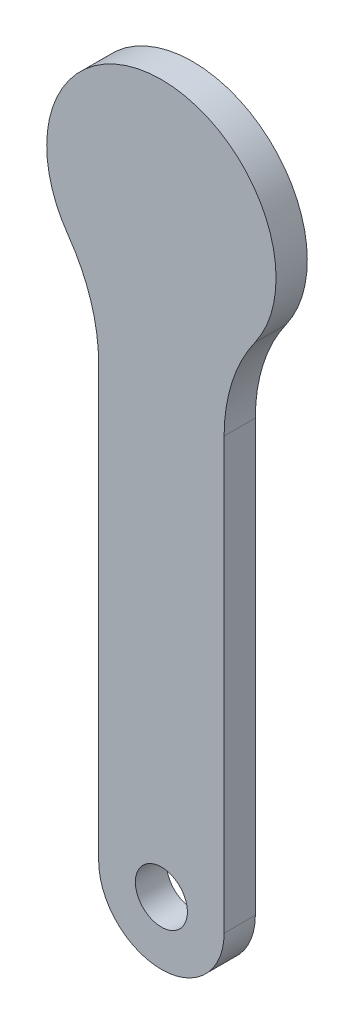
ISO-10303-21;
HEADER;
FILE_DESCRIPTION(('STEP AP214'),'2;1');
FILE_NAME('part.step','',(''),(''),'','','');
FILE_SCHEMA(('AUTOMOTIVE_DESIGN { 1 0 10303 214 1 1 1 1 }'));
ENDSEC;
DATA;
#1=APPLICATION_CONTEXT('core data for automotive mechanical design processes');
#2=APPLICATION_PROTOCOL_DEFINITION('international standard','automotive_design',2000,#1);
#3=PRODUCT_CONTEXT('',#1,'mechanical');
#4=PRODUCT('Part','Part','',(#3));
#5=PRODUCT_RELATED_PRODUCT_CATEGORY('part','',(#4));
#6=PRODUCT_DEFINITION_FORMATION('','',#4);
#7=PRODUCT_DEFINITION_CONTEXT('part definition',#1,'design');
#8=PRODUCT_DEFINITION('design','',#6,#7);
#9=PRODUCT_DEFINITION_SHAPE('','',#8);
#10=(LENGTH_UNIT() NAMED_UNIT(*) SI_UNIT(.MILLI.,.METRE.));
#11=(NAMED_UNIT(*) PLANE_ANGLE_UNIT() SI_UNIT($,.RADIAN.));
#12=(NAMED_UNIT(*) SI_UNIT($,.STERADIAN.) SOLID_ANGLE_UNIT());
#13=UNCERTAINTY_MEASURE_WITH_UNIT(LENGTH_MEASURE(1.E-05),#10,'distance_accuracy_value','');
#14=(GEOMETRIC_REPRESENTATION_CONTEXT(3) GLOBAL_UNCERTAINTY_ASSIGNED_CONTEXT((#13)) GLOBAL_UNIT_ASSIGNED_CONTEXT((#10,
#11,#12)) REPRESENTATION_CONTEXT('',''));
#15=CARTESIAN_POINT('',(0.,0.,0.));
#16=DIRECTION('',(0.,0.,1.));
#17=DIRECTION('',(1.,0.,0.));
#18=AXIS2_PLACEMENT_3D('',#15,#16,#17);
#19=CARTESIAN_POINT('',(22.0049394238987,-15.636232903161,3.));
#20=DIRECTION('',(0.,0.,-1.));
#21=DIRECTION('',(-1.,0.,0.));
#22=AXIS2_PLACEMENT_3D('',#19,#20,#21);
#23=PLANE('',#22);
#24=CARTESIAN_POINT('',(22.0049394238987,-15.636232903161,3.));
#25=DIRECTION('',(0.,0.,-1.));
#26=DIRECTION('',(-1.,0.,0.));
#27=AXIS2_PLACEMENT_3D('',#24,#25,#26);
#28=CIRCLE('',#27,15.9798002931745);
#29=CARTESIAN_POINT('',(6.02513913072419,-15.636232903161,3.));
#30=VERTEX_POINT('',#29);
#31=CARTESIAN_POINT('',(8.97883915477203,-6.38016844852385,3.));
#32=VERTEX_POINT('',#31);
#33=EDGE_CURVE('E131',#30,#32,#28,.T.);
#34=ORIENTED_EDGE('',*,*,#33,.T.);
#35=CARTESIAN_POINT('',(0.,0.,3.));
#36=DIRECTION('',(0.,0.,1.));
#37=DIRECTION('',(-1.,0.,0.));
#38=AXIS2_PLACEMENT_3D('',#35,#36,#37);
#39=CIRCLE('',#38,11.0148128444748);
#40=CARTESIAN_POINT('',(-8.97883915477204,-6.38016844852385,3.));
#41=VERTEX_POINT('',#40);
#42=EDGE_CURVE('E88',#32,#41,#39,.T.);
#43=ORIENTED_EDGE('',*,*,#42,.T.);
#44=CARTESIAN_POINT('',(-22.0049394238987,-15.636232903161,3.));
#45=DIRECTION('',(0.,0.,-1.));
#46=DIRECTION('',(1.,0.,0.));
#47=AXIS2_PLACEMENT_3D('',#44,#45,#46);
#48=CIRCLE('',#47,15.9798002931745);
#49=CARTESIAN_POINT('',(-6.02513913072419,-15.636232903161,3.));
#50=VERTEX_POINT('',#49);
#51=EDGE_CURVE('E101',#41,#50,#48,.T.);
#52=ORIENTED_EDGE('',*,*,#51,.T.);
#53=DIRECTION('',(0.,-1.,0.));
#54=VECTOR('',#53,1.);
#55=CARTESIAN_POINT('',(-6.02513913072419,-15.636232903161,3.));
#56=LINE('',#55,#54);
#57=CARTESIAN_POINT('',(-6.02513913072419,-57.,3.));
#58=VERTEX_POINT('',#57);
#59=EDGE_CURVE('E95',#50,#58,#56,.T.);
#60=ORIENTED_EDGE('',*,*,#59,.T.);
#61=CARTESIAN_POINT('',(0.,-57.,3.));
#62=DIRECTION('',(0.,0.,1.));
#63=DIRECTION('',(1.,0.,0.));
#64=AXIS2_PLACEMENT_3D('',#61,#62,#63);
#65=CIRCLE('',#64,6.0251391307242);
#66=CARTESIAN_POINT('',(6.0251391307242,-57.,3.));
#67=VERTEX_POINT('',#66);
#68=EDGE_CURVE('E99',#58,#67,#65,.T.);
#69=ORIENTED_EDGE('',*,*,#68,.T.);
#70=DIRECTION('',(0.,1.,0.));
#71=VECTOR('',#70,1.);
#72=CARTESIAN_POINT('',(6.02513913072419,-15.636232903161,3.));
#73=LINE('',#72,#71);
#74=EDGE_CURVE('E52',#67,#30,#73,.T.);
#75=ORIENTED_EDGE('',*,*,#74,.T.);
#76=EDGE_LOOP('',(#34,#43,#52,#60,#69,#75));
#77=FACE_BOUND('',#76,.T.);
#78=CARTESIAN_POINT('',(0.,-57.,3.));
#79=DIRECTION('',(0.,0.,1.));
#80=DIRECTION('',(1.,0.,0.));
#81=AXIS2_PLACEMENT_3D('',#78,#79,#80);
#82=CIRCLE('',#81,2.5);
#83=CARTESIAN_POINT('',(2.50000000000001,-57.,3.));
#84=VERTEX_POINT('',#83);
#85=EDGE_CURVE('E124',#84,#84,#82,.T.);
#86=ORIENTED_EDGE('',*,*,#85,.F.);
#87=EDGE_LOOP('',(#86));
#88=FACE_BOUND('',#87,.T.);
#89=ADVANCED_FACE('F35',(#77,#88),#23,.F.);
#90=CARTESIAN_POINT('',(22.0049394238987,-15.636232903161,0.));
#91=DIRECTION('',(0.,0.,-1.));
#92=DIRECTION('',(-1.,0.,0.));
#93=AXIS2_PLACEMENT_3D('',#90,#91,#92);
#94=PLANE('',#93);
#95=CARTESIAN_POINT('',(22.0049394238987,-15.636232903161,0.));
#96=DIRECTION('',(0.,0.,-1.));
#97=DIRECTION('',(-1.,0.,0.));
#98=AXIS2_PLACEMENT_3D('',#95,#96,#97);
#99=CIRCLE('',#98,15.9798002931745);
#100=CARTESIAN_POINT('',(6.02513913072419,-15.636232903161,0.));
#101=VERTEX_POINT('',#100);
#102=CARTESIAN_POINT('',(8.97883915477203,-6.38016844852385,0.));
#103=VERTEX_POINT('',#102);
#104=EDGE_CURVE('E120',#101,#103,#99,.T.);
#105=ORIENTED_EDGE('',*,*,#104,.F.);
#106=DIRECTION('',(0.,1.,0.));
#107=VECTOR('',#106,1.);
#108=CARTESIAN_POINT('',(6.02513913072419,-15.636232903161,0.));
#109=LINE('',#108,#107);
#110=CARTESIAN_POINT('',(6.0251391307242,-57.,0.));
#111=VERTEX_POINT('',#110);
#112=EDGE_CURVE('E80',#111,#101,#109,.T.);
#113=ORIENTED_EDGE('',*,*,#112,.F.);
#114=CARTESIAN_POINT('',(0.,-57.,0.));
#115=DIRECTION('',(0.,0.,1.));
#116=DIRECTION('',(-1.,0.,0.));
#117=AXIS2_PLACEMENT_3D('',#114,#115,#116);
#118=CIRCLE('',#117,6.0251391307242);
#119=CARTESIAN_POINT('',(-6.02513913072419,-57.,0.));
#120=VERTEX_POINT('',#119);
#121=EDGE_CURVE('E74',#120,#111,#118,.T.);
#122=ORIENTED_EDGE('',*,*,#121,.F.);
#123=DIRECTION('',(0.,-1.,0.));
#124=VECTOR('',#123,1.);
#125=CARTESIAN_POINT('',(-6.02513913072419,-15.636232903161,0.));
#126=LINE('',#125,#124);
#127=CARTESIAN_POINT('',(-6.02513913072419,-15.636232903161,0.));
#128=VERTEX_POINT('',#127);
#129=EDGE_CURVE('E110',#128,#120,#126,.T.);
#130=ORIENTED_EDGE('',*,*,#129,.F.);
#131=CARTESIAN_POINT('',(-22.0049394238987,-15.636232903161,0.));
#132=DIRECTION('',(0.,0.,-1.));
#133=DIRECTION('',(1.,0.,0.));
#134=AXIS2_PLACEMENT_3D('',#131,#132,#133);
#135=CIRCLE('',#134,15.9798002931745);
#136=CARTESIAN_POINT('',(-8.97883915477204,-6.38016844852385,0.));
#137=VERTEX_POINT('',#136);
#138=EDGE_CURVE('E126',#137,#128,#135,.T.);
#139=ORIENTED_EDGE('',*,*,#138,.F.);
#140=CARTESIAN_POINT('',(0.,0.,0.));
#141=DIRECTION('',(0.,0.,1.));
#142=DIRECTION('',(-1.,0.,0.));
#143=AXIS2_PLACEMENT_3D('',#140,#141,#142);
#144=CIRCLE('',#143,11.0148128444748);
#145=EDGE_CURVE('E123',#103,#137,#144,.T.);
#146=ORIENTED_EDGE('',*,*,#145,.F.);
#147=EDGE_LOOP('',(#105,#113,#122,#130,#139,#146));
#148=FACE_BOUND('',#147,.T.);
#149=CARTESIAN_POINT('',(0.,-57.,0.));
#150=DIRECTION('',(0.,0.,1.));
#151=DIRECTION('',(1.,0.,0.));
#152=AXIS2_PLACEMENT_3D('',#149,#150,#151);
#153=CIRCLE('',#152,2.5);
#154=CARTESIAN_POINT('',(2.50000000000001,-57.,0.));
#155=VERTEX_POINT('',#154);
#156=EDGE_CURVE('E227',#155,#155,#153,.T.);
#157=ORIENTED_EDGE('',*,*,#156,.T.);
#158=EDGE_LOOP('',(#157));
#159=FACE_BOUND('',#158,.T.);
#160=ADVANCED_FACE('F140',(#148,#159),#94,.T.);
#161=CARTESIAN_POINT('',(22.0049394238987,-15.636232903161,3.));
#162=DIRECTION('',(0.,0.,-1.));
#163=DIRECTION('',(-1.,0.,0.));
#164=AXIS2_PLACEMENT_3D('',#161,#162,#163);
#165=CYLINDRICAL_SURFACE('',#164,15.9798002931745);
#166=ORIENTED_EDGE('',*,*,#104,.T.);
#167=DIRECTION('',(0.,0.,-1.));
#168=VECTOR('',#167,1.);
#169=CARTESIAN_POINT('',(8.97883915477203,-6.38016844852385,3.));
#170=LINE('',#169,#168);
#171=EDGE_CURVE('E11',#32,#103,#170,.T.);
#172=ORIENTED_EDGE('',*,*,#171,.F.);
#173=ORIENTED_EDGE('',*,*,#33,.F.);
#174=DIRECTION('',(0.,0.,-1.));
#175=VECTOR('',#174,1.);
#176=CARTESIAN_POINT('',(6.02513913072419,-15.636232903161,3.));
#177=LINE('',#176,#175);
#178=EDGE_CURVE('E116',#30,#101,#177,.T.);
#179=ORIENTED_EDGE('',*,*,#178,.T.);
#180=EDGE_LOOP('',(#166,#172,#173,#179));
#181=FACE_BOUND('',#180,.T.);
#182=ADVANCED_FACE('F37',(#181),#165,.F.);
#183=CARTESIAN_POINT('',(0.,0.,3.));
#184=DIRECTION('',(0.,0.,-1.));
#185=DIRECTION('',(-1.,0.,0.));
#186=AXIS2_PLACEMENT_3D('',#183,#184,#185);
#187=CYLINDRICAL_SURFACE('',#186,11.0148128444748);
#188=ORIENTED_EDGE('',*,*,#145,.T.);
#189=DIRECTION('',(0.,0.,-1.));
#190=VECTOR('',#189,1.);
#191=CARTESIAN_POINT('',(-8.97883915477204,-6.38016844852385,3.));
#192=LINE('',#191,#190);
#193=EDGE_CURVE('E44',#41,#137,#192,.T.);
#194=ORIENTED_EDGE('',*,*,#193,.F.);
#195=ORIENTED_EDGE('',*,*,#42,.F.);
#196=ORIENTED_EDGE('',*,*,#171,.T.);
#197=EDGE_LOOP('',(#188,#194,#195,#196));
#198=FACE_BOUND('',#197,.T.);
#199=ADVANCED_FACE('F165',(#198),#187,.T.);
#200=CARTESIAN_POINT('',(-22.0049394238987,-15.636232903161,3.));
#201=DIRECTION('',(0.,0.,-1.));
#202=DIRECTION('',(-1.,0.,0.));
#203=AXIS2_PLACEMENT_3D('',#200,#201,#202);
#204=CYLINDRICAL_SURFACE('',#203,15.9798002931745);
#205=ORIENTED_EDGE('',*,*,#138,.T.);
#206=DIRECTION('',(0.,0.,-1.));
#207=VECTOR('',#206,1.);
#208=CARTESIAN_POINT('',(-6.02513913072419,-15.636232903161,3.));
#209=LINE('',#208,#207);
#210=EDGE_CURVE('E111',#50,#128,#209,.T.);
#211=ORIENTED_EDGE('',*,*,#210,.F.);
#212=ORIENTED_EDGE('',*,*,#51,.F.);
#213=ORIENTED_EDGE('',*,*,#193,.T.);
#214=EDGE_LOOP('',(#205,#211,#212,#213));
#215=FACE_BOUND('',#214,.T.);
#216=ADVANCED_FACE('F137',(#215),#204,.F.);
#217=CARTESIAN_POINT('',(-6.02513913072419,-15.636232903161,3.));
#218=DIRECTION('',(1.,0.,0.));
#219=DIRECTION('',(0.,1.,0.));
#220=AXIS2_PLACEMENT_3D('',#217,#218,#219);
#221=PLANE('',#220);
#222=ORIENTED_EDGE('',*,*,#129,.T.);
#223=DIRECTION('',(0.,0.,-1.));
#224=VECTOR('',#223,1.);
#225=CARTESIAN_POINT('',(-6.02513913072419,-57.,3.));
#226=LINE('',#225,#224);
#227=EDGE_CURVE('E107',#58,#120,#226,.T.);
#228=ORIENTED_EDGE('',*,*,#227,.F.);
#229=ORIENTED_EDGE('',*,*,#59,.F.);
#230=ORIENTED_EDGE('',*,*,#210,.T.);
#231=EDGE_LOOP('',(#222,#228,#229,#230));
#232=FACE_BOUND('',#231,.T.);
#233=ADVANCED_FACE('F108',(#232),#221,.F.);
#234=CARTESIAN_POINT('',(0.,-57.,3.));
#235=DIRECTION('',(0.,0.,-1.));
#236=DIRECTION('',(-1.,0.,0.));
#237=AXIS2_PLACEMENT_3D('',#234,#235,#236);
#238=CYLINDRICAL_SURFACE('',#237,6.0251391307242);
#239=ORIENTED_EDGE('',*,*,#121,.T.);
#240=DIRECTION('',(0.,0.,-1.));
#241=VECTOR('',#240,1.);
#242=CARTESIAN_POINT('',(6.0251391307242,-57.,3.));
#243=LINE('',#242,#241);
#244=EDGE_CURVE('E112',#67,#111,#243,.T.);
#245=ORIENTED_EDGE('',*,*,#244,.F.);
#246=ORIENTED_EDGE('',*,*,#68,.F.);
#247=ORIENTED_EDGE('',*,*,#227,.T.);
#248=EDGE_LOOP('',(#239,#245,#246,#247));
#249=FACE_BOUND('',#248,.T.);
#250=ADVANCED_FACE('F114',(#249),#238,.T.);
#251=CARTESIAN_POINT('',(6.02513913072419,-15.636232903161,3.));
#252=DIRECTION('',(-1.,0.,0.));
#253=DIRECTION('',(0.,-1.,0.));
#254=AXIS2_PLACEMENT_3D('',#251,#252,#253);
#255=PLANE('',#254);
#256=ORIENTED_EDGE('',*,*,#112,.T.);
#257=ORIENTED_EDGE('',*,*,#178,.F.);
#258=ORIENTED_EDGE('',*,*,#74,.F.);
#259=ORIENTED_EDGE('',*,*,#244,.T.);
#260=EDGE_LOOP('',(#256,#257,#258,#259));
#261=FACE_BOUND('',#260,.T.);
#262=ADVANCED_FACE('F145',(#261),#255,.F.);
#263=CARTESIAN_POINT('',(0.,-57.,3.));
#264=DIRECTION('',(0.,0.,-1.));
#265=DIRECTION('',(-1.,0.,0.));
#266=AXIS2_PLACEMENT_3D('',#263,#264,#265);
#267=CYLINDRICAL_SURFACE('',#266,2.5);
#268=ORIENTED_EDGE('',*,*,#85,.T.);
#269=EDGE_LOOP('',(#268));
#270=FACE_BOUND('',#269,.T.);
#271=ORIENTED_EDGE('',*,*,#156,.F.);
#272=EDGE_LOOP('',(#271));
#273=FACE_BOUND('',#272,.T.);
#274=ADVANCED_FACE('F147',(#270,#273),#267,.F.);
#275=CLOSED_SHELL('',(#89,#160,#182,#199,#216,#233,#250,#262,#274));
#276=MANIFOLD_SOLID_BREP('B2',#275);
#277=ADVANCED_BREP_SHAPE_REPRESENTATION('',(#18,#276),#14);
#278=SHAPE_DEFINITION_REPRESENTATION(#9,#277);
ENDSEC;
END-ISO-10303-21;
